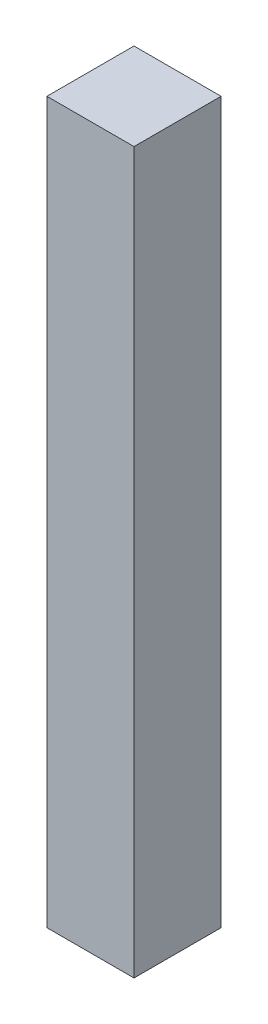
ISO-10303-21;
HEADER;
FILE_DESCRIPTION(('STEP AP214'),'2;1');
FILE_NAME('part.step','',(''),(''),'','','');
FILE_SCHEMA(('AUTOMOTIVE_DESIGN { 1 0 10303 214 1 1 1 1 }'));
ENDSEC;
DATA;
#1=APPLICATION_CONTEXT('core data for automotive mechanical design processes');
#2=APPLICATION_PROTOCOL_DEFINITION('international standard','automotive_design',2000,#1);
#3=PRODUCT_CONTEXT('',#1,'mechanical');
#4=PRODUCT('Part','Part','',(#3));
#5=PRODUCT_RELATED_PRODUCT_CATEGORY('part','',(#4));
#6=PRODUCT_DEFINITION_FORMATION('','',#4);
#7=PRODUCT_DEFINITION_CONTEXT('part definition',#1,'design');
#8=PRODUCT_DEFINITION('design','',#6,#7);
#9=PRODUCT_DEFINITION_SHAPE('','',#8);
#10=(LENGTH_UNIT() NAMED_UNIT(*) SI_UNIT(.MILLI.,.METRE.));
#11=(NAMED_UNIT(*) PLANE_ANGLE_UNIT() SI_UNIT($,.RADIAN.));
#12=(NAMED_UNIT(*) SI_UNIT($,.STERADIAN.) SOLID_ANGLE_UNIT());
#13=UNCERTAINTY_MEASURE_WITH_UNIT(LENGTH_MEASURE(1.E-05),#10,'distance_accuracy_value','');
#14=(GEOMETRIC_REPRESENTATION_CONTEXT(3) GLOBAL_UNCERTAINTY_ASSIGNED_CONTEXT((#13)) GLOBAL_UNIT_ASSIGNED_CONTEXT((#10,
#11,#12)) REPRESENTATION_CONTEXT('',''));
#15=CARTESIAN_POINT('',(0.,0.,0.));
#16=DIRECTION('',(0.,0.,1.));
#17=DIRECTION('',(1.,0.,0.));
#18=AXIS2_PLACEMENT_3D('',#15,#16,#17);
#19=CARTESIAN_POINT('',(-39.8355089835924,210.,-18.6136158048334));
#20=DIRECTION('',(1.,0.,0.));
#21=DIRECTION('',(0.,0.,-1.));
#22=AXIS2_PLACEMENT_3D('',#19,#20,#21);
#23=PLANE('',#22);
#24=DIRECTION('',(0.,0.,1.));
#25=VECTOR('',#24,1.);
#26=CARTESIAN_POINT('',(-39.8355089835924,0.,-18.6136158048334));
#27=LINE('',#26,#25);
#28=CARTESIAN_POINT('',(-39.8355089835924,0.,-18.6136158048334));
#29=VERTEX_POINT('',#28);
#30=CARTESIAN_POINT('',(-39.8355089835924,0.,6.78638419516663));
#31=VERTEX_POINT('',#30);
#32=EDGE_CURVE('E94',#29,#31,#27,.T.);
#33=ORIENTED_EDGE('',*,*,#32,.T.);
#34=DIRECTION('',(0.,-1.,0.));
#35=VECTOR('',#34,1.);
#36=CARTESIAN_POINT('',(-39.8355089835924,210.,6.78638419516663));
#37=LINE('',#36,#35);
#38=CARTESIAN_POINT('',(-39.8355089835924,210.,6.78638419516663));
#39=VERTEX_POINT('',#38);
#40=EDGE_CURVE('E11',#39,#31,#37,.T.);
#41=ORIENTED_EDGE('',*,*,#40,.F.);
#42=DIRECTION('',(0.,0.,1.));
#43=VECTOR('',#42,1.);
#44=CARTESIAN_POINT('',(-39.8355089835924,210.,-18.6136158048334));
#45=LINE('',#44,#43);
#46=CARTESIAN_POINT('',(-39.8355089835924,210.,-18.6136158048334));
#47=VERTEX_POINT('',#46);
#48=EDGE_CURVE('E82',#47,#39,#45,.T.);
#49=ORIENTED_EDGE('',*,*,#48,.F.);
#50=DIRECTION('',(0.,-1.,0.));
#51=VECTOR('',#50,1.);
#52=CARTESIAN_POINT('',(-39.8355089835924,210.,-18.6136158048334));
#53=LINE('',#52,#51);
#54=EDGE_CURVE('E90',#47,#29,#53,.T.);
#55=ORIENTED_EDGE('',*,*,#54,.T.);
#56=EDGE_LOOP('',(#33,#41,#49,#55));
#57=FACE_BOUND('',#56,.T.);
#58=ADVANCED_FACE('F31',(#57),#23,.F.);
#59=CARTESIAN_POINT('',(-39.8355089835924,210.,6.78638419516663));
#60=DIRECTION('',(0.,0.,-1.));
#61=DIRECTION('',(-1.,0.,0.));
#62=AXIS2_PLACEMENT_3D('',#59,#60,#61);
#63=PLANE('',#62);
#64=DIRECTION('',(1.,0.,0.));
#65=VECTOR('',#64,1.);
#66=CARTESIAN_POINT('',(-39.8355089835924,0.,6.78638419516663));
#67=LINE('',#66,#65);
#68=CARTESIAN_POINT('',(-14.4355089835924,0.,6.78638419516663));
#69=VERTEX_POINT('',#68);
#70=EDGE_CURVE('E86',#31,#69,#67,.T.);
#71=ORIENTED_EDGE('',*,*,#70,.T.);
#72=DIRECTION('',(0.,-1.,0.));
#73=VECTOR('',#72,1.);
#74=CARTESIAN_POINT('',(-14.4355089835924,210.,6.78638419516663));
#75=LINE('',#74,#73);
#76=CARTESIAN_POINT('',(-14.4355089835924,210.,6.78638419516663));
#77=VERTEX_POINT('',#76);
#78=EDGE_CURVE('E39',#77,#69,#75,.T.);
#79=ORIENTED_EDGE('',*,*,#78,.F.);
#80=DIRECTION('',(1.,0.,0.));
#81=VECTOR('',#80,1.);
#82=CARTESIAN_POINT('',(-39.8355089835924,210.,6.78638419516663));
#83=LINE('',#82,#81);
#84=EDGE_CURVE('E77',#39,#77,#83,.T.);
#85=ORIENTED_EDGE('',*,*,#84,.F.);
#86=ORIENTED_EDGE('',*,*,#40,.T.);
#87=EDGE_LOOP('',(#71,#79,#85,#86));
#88=FACE_BOUND('',#87,.T.);
#89=ADVANCED_FACE('F85',(#88),#63,.F.);
#90=CARTESIAN_POINT('',(-14.4355089835924,210.,-18.6136158048334));
#91=DIRECTION('',(-1.,0.,0.));
#92=DIRECTION('',(0.,0.,1.));
#93=AXIS2_PLACEMENT_3D('',#90,#91,#92);
#94=PLANE('',#93);
#95=DIRECTION('',(0.,0.,-1.));
#96=VECTOR('',#95,1.);
#97=CARTESIAN_POINT('',(-14.4355089835924,0.,-18.6136158048334));
#98=LINE('',#97,#96);
#99=CARTESIAN_POINT('',(-14.4355089835924,0.,-18.6136158048334));
#100=VERTEX_POINT('',#99);
#101=EDGE_CURVE('E64',#69,#100,#98,.T.);
#102=ORIENTED_EDGE('',*,*,#101,.T.);
#103=DIRECTION('',(0.,-1.,0.));
#104=VECTOR('',#103,1.);
#105=CARTESIAN_POINT('',(-14.4355089835924,210.,-18.6136158048334));
#106=LINE('',#105,#104);
#107=CARTESIAN_POINT('',(-14.4355089835924,210.,-18.6136158048334));
#108=VERTEX_POINT('',#107);
#109=EDGE_CURVE('E87',#108,#100,#106,.T.);
#110=ORIENTED_EDGE('',*,*,#109,.F.);
#111=DIRECTION('',(0.,0.,-1.));
#112=VECTOR('',#111,1.);
#113=CARTESIAN_POINT('',(-14.4355089835924,210.,-18.6136158048334));
#114=LINE('',#113,#112);
#115=EDGE_CURVE('E80',#77,#108,#114,.T.);
#116=ORIENTED_EDGE('',*,*,#115,.F.);
#117=ORIENTED_EDGE('',*,*,#78,.T.);
#118=EDGE_LOOP('',(#102,#110,#116,#117));
#119=FACE_BOUND('',#118,.T.);
#120=ADVANCED_FACE('F88',(#119),#94,.F.);
#121=CARTESIAN_POINT('',(-39.8355089835924,210.,-18.6136158048334));
#122=DIRECTION('',(0.,0.,1.));
#123=DIRECTION('',(1.,0.,0.));
#124=AXIS2_PLACEMENT_3D('',#121,#122,#123);
#125=PLANE('',#124);
#126=DIRECTION('',(-1.,0.,0.));
#127=VECTOR('',#126,1.);
#128=CARTESIAN_POINT('',(-39.8355089835924,0.,-18.6136158048334));
#129=LINE('',#128,#127);
#130=EDGE_CURVE('E70',#100,#29,#129,.T.);
#131=ORIENTED_EDGE('',*,*,#130,.T.);
#132=ORIENTED_EDGE('',*,*,#54,.F.);
#133=DIRECTION('',(-1.,0.,0.));
#134=VECTOR('',#133,1.);
#135=CARTESIAN_POINT('',(-39.8355089835924,210.,-18.6136158048334));
#136=LINE('',#135,#134);
#137=EDGE_CURVE('E47',#108,#47,#136,.T.);
#138=ORIENTED_EDGE('',*,*,#137,.F.);
#139=ORIENTED_EDGE('',*,*,#109,.T.);
#140=EDGE_LOOP('',(#131,#132,#138,#139));
#141=FACE_BOUND('',#140,.T.);
#142=ADVANCED_FACE('F101',(#141),#125,.F.);
#143=CARTESIAN_POINT('',(-39.8355089835924,210.,6.78638419516663));
#144=DIRECTION('',(0.,1.,0.));
#145=DIRECTION('',(0.,0.,1.));
#146=AXIS2_PLACEMENT_3D('',#143,#144,#145);
#147=PLANE('',#146);
#148=ORIENTED_EDGE('',*,*,#48,.T.);
#149=ORIENTED_EDGE('',*,*,#84,.T.);
#150=ORIENTED_EDGE('',*,*,#115,.T.);
#151=ORIENTED_EDGE('',*,*,#137,.T.);
#152=EDGE_LOOP('',(#148,#149,#150,#151));
#153=FACE_BOUND('',#152,.T.);
#154=ADVANCED_FACE('F78',(#153),#147,.T.);
#155=CARTESIAN_POINT('',(-39.8355089835924,0.,6.78638419516663));
#156=DIRECTION('',(0.,1.,0.));
#157=DIRECTION('',(0.,0.,1.));
#158=AXIS2_PLACEMENT_3D('',#155,#156,#157);
#159=PLANE('',#158);
#160=ORIENTED_EDGE('',*,*,#32,.F.);
#161=ORIENTED_EDGE('',*,*,#130,.F.);
#162=ORIENTED_EDGE('',*,*,#101,.F.);
#163=ORIENTED_EDGE('',*,*,#70,.F.);
#164=EDGE_LOOP('',(#160,#161,#162,#163));
#165=FACE_BOUND('',#164,.T.);
#166=ADVANCED_FACE('F104',(#165),#159,.F.);
#167=CLOSED_SHELL('',(#58,#89,#120,#142,#154,#166));
#168=MANIFOLD_SOLID_BREP('B2',#167);
#169=ADVANCED_BREP_SHAPE_REPRESENTATION('',(#18,#168),#14);
#170=SHAPE_DEFINITION_REPRESENTATION(#9,#169);
ENDSEC;
END-ISO-10303-21;
